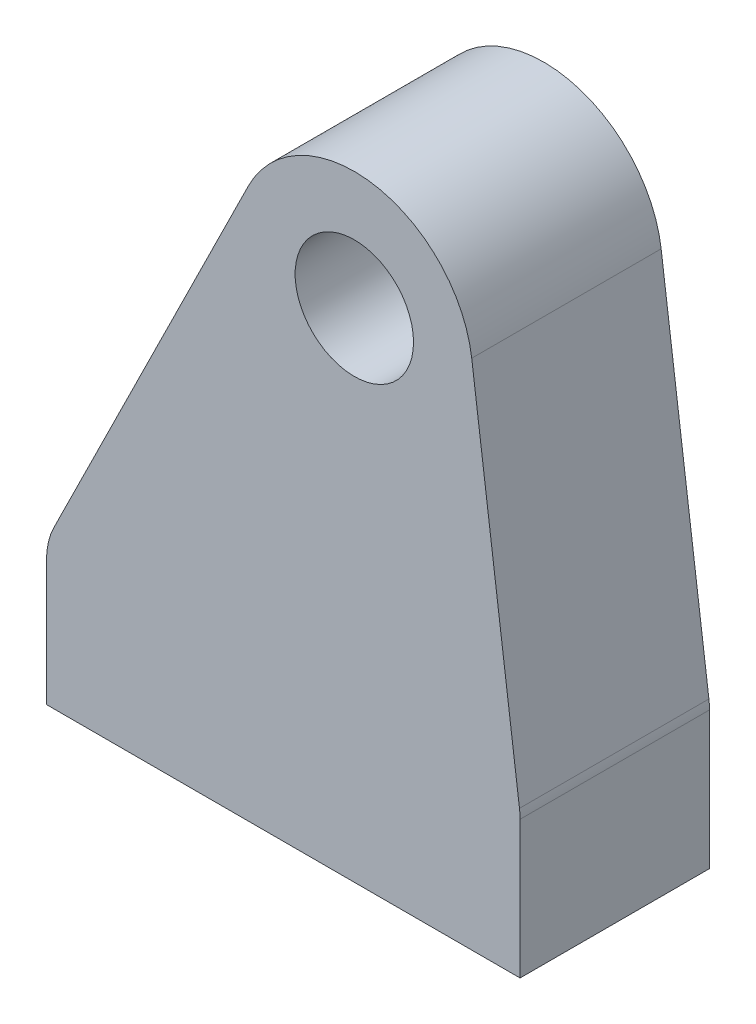
ISO-10303-21;
HEADER;
FILE_DESCRIPTION(('STEP AP214'),'2;1');
FILE_NAME('part.step','',(''),(''),'','','');
FILE_SCHEMA(('AUTOMOTIVE_DESIGN { 1 0 10303 214 1 1 1 1 }'));
ENDSEC;
DATA;
#1=APPLICATION_CONTEXT('core data for automotive mechanical design processes');
#2=APPLICATION_PROTOCOL_DEFINITION('international standard','automotive_design',2000,#1);
#3=PRODUCT_CONTEXT('',#1,'mechanical');
#4=PRODUCT('Part','Part','',(#3));
#5=PRODUCT_RELATED_PRODUCT_CATEGORY('part','',(#4));
#6=PRODUCT_DEFINITION_FORMATION('','',#4);
#7=PRODUCT_DEFINITION_CONTEXT('part definition',#1,'design');
#8=PRODUCT_DEFINITION('design','',#6,#7);
#9=PRODUCT_DEFINITION_SHAPE('','',#8);
#10=(LENGTH_UNIT() NAMED_UNIT(*) SI_UNIT(.MILLI.,.METRE.));
#11=(NAMED_UNIT(*) PLANE_ANGLE_UNIT() SI_UNIT($,.RADIAN.));
#12=(NAMED_UNIT(*) SI_UNIT($,.STERADIAN.) SOLID_ANGLE_UNIT());
#13=UNCERTAINTY_MEASURE_WITH_UNIT(LENGTH_MEASURE(1.E-05),#10,'distance_accuracy_value','');
#14=(GEOMETRIC_REPRESENTATION_CONTEXT(3) GLOBAL_UNCERTAINTY_ASSIGNED_CONTEXT((#13)) GLOBAL_UNIT_ASSIGNED_CONTEXT((#10,
#11,#12)) REPRESENTATION_CONTEXT('',''));
#15=CARTESIAN_POINT('',(0.,0.,0.));
#16=DIRECTION('',(0.,0.,1.));
#17=DIRECTION('',(1.,0.,0.));
#18=AXIS2_PLACEMENT_3D('',#15,#16,#17);
#19=CARTESIAN_POINT('',(3.,21.,8.));
#20=DIRECTION('',(0.,0.,1.));
#21=DIRECTION('',(1.,0.,0.));
#22=AXIS2_PLACEMENT_3D('',#19,#20,#21);
#23=PLANE('',#22);
#24=DIRECTION('',(0.,1.,0.));
#25=VECTOR('',#24,1.);
#26=CARTESIAN_POINT('',(10.,0.,8.));
#27=LINE('',#26,#25);
#28=CARTESIAN_POINT('',(10.,0.,8.));
#29=VERTEX_POINT('',#28);
#30=CARTESIAN_POINT('',(10.,5.80506654048513,8.));
#31=VERTEX_POINT('',#30);
#32=EDGE_CURVE('E117',#29,#31,#27,.T.);
#33=ORIENTED_EDGE('',*,*,#32,.T.);
#34=CARTESIAN_POINT('',(7.,5.80506654048513,8.));
#35=DIRECTION('',(0.,0.,1.));
#36=DIRECTION('',(1.,0.,0.));
#37=AXIS2_PLACEMENT_3D('',#34,#35,#36);
#38=CIRCLE('',#37,3.);
#39=CARTESIAN_POINT('',(9.97477380552072,6.1932943163948,8.));
#40=VERTEX_POINT('',#39);
#41=EDGE_CURVE('E138',#31,#40,#38,.T.);
#42=ORIENTED_EDGE('',*,*,#41,.T.);
#43=DIRECTION('',(-0.129409258636557,0.991591268506907,0.));
#44=VECTOR('',#43,1.);
#45=CARTESIAN_POINT('',(7.95795634253453,21.6470462931828,8.));
#46=LINE('',#45,#44);
#47=CARTESIAN_POINT('',(7.95795634253453,21.6470462931828,8.));
#48=VERTEX_POINT('',#47);
#49=EDGE_CURVE('E335',#40,#48,#46,.T.);
#50=ORIENTED_EDGE('',*,*,#49,.T.);
#51=CARTESIAN_POINT('',(3.,21.,8.));
#52=DIRECTION('',(0.,0.,1.));
#53=DIRECTION('',(1.,0.,0.));
#54=AXIS2_PLACEMENT_3D('',#51,#52,#53);
#55=CIRCLE('',#54,5.);
#56=CARTESIAN_POINT('',(-1.48147957721419,23.2172823002523,8.));
#57=VERTEX_POINT('',#56);
#58=EDGE_CURVE('E174',#48,#57,#55,.T.);
#59=ORIENTED_EDGE('',*,*,#58,.T.);
#60=DIRECTION('',(-0.443456460050459,-0.896295915442838,0.));
#61=VECTOR('',#60,1.);
#62=CARTESIAN_POINT('',(-10.,6.,8.));
#63=LINE('',#62,#61);
#64=CARTESIAN_POINT('',(-9.68888774632852,6.62880726143495,8.));
#65=VERTEX_POINT('',#64);
#66=EDGE_CURVE('E155',#57,#65,#63,.T.);
#67=ORIENTED_EDGE('',*,*,#66,.T.);
#68=CARTESIAN_POINT('',(-7.,5.29843788128358,8.));
#69=DIRECTION('',(0.,0.,1.));
#70=DIRECTION('',(1.,0.,0.));
#71=AXIS2_PLACEMENT_3D('',#68,#69,#70);
#72=CIRCLE('',#71,3.);
#73=CARTESIAN_POINT('',(-10.,5.29843788128357,8.));
#74=VERTEX_POINT('',#73);
#75=EDGE_CURVE('E56',#65,#74,#72,.T.);
#76=ORIENTED_EDGE('',*,*,#75,.T.);
#77=DIRECTION('',(0.,-1.,0.));
#78=VECTOR('',#77,1.);
#79=CARTESIAN_POINT('',(-10.,6.,8.));
#80=LINE('',#79,#78);
#81=CARTESIAN_POINT('',(-10.,0.,8.));
#82=VERTEX_POINT('',#81);
#83=EDGE_CURVE('E98',#74,#82,#80,.T.);
#84=ORIENTED_EDGE('',*,*,#83,.T.);
#85=DIRECTION('',(1.,0.,0.));
#86=VECTOR('',#85,1.);
#87=CARTESIAN_POINT('',(-10.,0.,8.));
#88=LINE('',#87,#86);
#89=EDGE_CURVE('E102',#82,#29,#88,.T.);
#90=ORIENTED_EDGE('',*,*,#89,.T.);
#91=EDGE_LOOP('',(#33,#42,#50,#59,#67,#76,#84,#90));
#92=FACE_BOUND('',#91,.T.);
#93=CARTESIAN_POINT('',(3.,21.,8.));
#94=DIRECTION('',(0.,0.,1.));
#95=DIRECTION('',(1.,0.,0.));
#96=AXIS2_PLACEMENT_3D('',#93,#94,#95);
#97=CIRCLE('',#96,2.5);
#98=CARTESIAN_POINT('',(5.5,21.,8.));
#99=VERTEX_POINT('',#98);
#100=EDGE_CURVE('E147',#99,#99,#97,.T.);
#101=ORIENTED_EDGE('',*,*,#100,.F.);
#102=EDGE_LOOP('',(#101));
#103=FACE_BOUND('',#102,.T.);
#104=ADVANCED_FACE('F36',(#92,#103),#23,.T.);
#105=CARTESIAN_POINT('',(3.,21.,0.));
#106=DIRECTION('',(0.,0.,1.));
#107=DIRECTION('',(1.,0.,0.));
#108=AXIS2_PLACEMENT_3D('',#105,#106,#107);
#109=PLANE('',#108);
#110=DIRECTION('',(-0.129409258636557,0.991591268506907,0.));
#111=VECTOR('',#110,1.);
#112=CARTESIAN_POINT('',(7.95795634253453,21.6470462931828,0.));
#113=LINE('',#112,#111);
#114=CARTESIAN_POINT('',(9.97477380552072,6.1932943163948,0.));
#115=VERTEX_POINT('',#114);
#116=CARTESIAN_POINT('',(7.95795634253453,21.6470462931828,0.));
#117=VERTEX_POINT('',#116);
#118=EDGE_CURVE('E160',#115,#117,#113,.T.);
#119=ORIENTED_EDGE('',*,*,#118,.F.);
#120=CARTESIAN_POINT('',(7.,5.80506654048513,0.));
#121=DIRECTION('',(0.,0.,1.));
#122=DIRECTION('',(1.,0.,0.));
#123=AXIS2_PLACEMENT_3D('',#120,#121,#122);
#124=CIRCLE('',#123,3.);
#125=CARTESIAN_POINT('',(10.,5.80506654048513,0.));
#126=VERTEX_POINT('',#125);
#127=EDGE_CURVE('E133',#115,#126,#124,.F.);
#128=ORIENTED_EDGE('',*,*,#127,.T.);
#129=DIRECTION('',(0.,1.,0.));
#130=VECTOR('',#129,1.);
#131=CARTESIAN_POINT('',(10.,0.,0.));
#132=LINE('',#131,#130);
#133=CARTESIAN_POINT('',(10.,0.,0.));
#134=VERTEX_POINT('',#133);
#135=EDGE_CURVE('E149',#134,#126,#132,.T.);
#136=ORIENTED_EDGE('',*,*,#135,.F.);
#137=DIRECTION('',(1.,0.,0.));
#138=VECTOR('',#137,1.);
#139=CARTESIAN_POINT('',(-10.,0.,0.));
#140=LINE('',#139,#138);
#141=CARTESIAN_POINT('',(-10.,0.,0.));
#142=VERTEX_POINT('',#141);
#143=EDGE_CURVE('E146',#142,#134,#140,.T.);
#144=ORIENTED_EDGE('',*,*,#143,.F.);
#145=DIRECTION('',(0.,-1.,0.));
#146=VECTOR('',#145,1.);
#147=CARTESIAN_POINT('',(-10.,6.,0.));
#148=LINE('',#147,#146);
#149=CARTESIAN_POINT('',(-10.,5.29843788128357,0.));
#150=VERTEX_POINT('',#149);
#151=EDGE_CURVE('E121',#150,#142,#148,.T.);
#152=ORIENTED_EDGE('',*,*,#151,.F.);
#153=CARTESIAN_POINT('',(-7.,5.29843788128358,0.));
#154=DIRECTION('',(0.,0.,1.));
#155=DIRECTION('',(1.,0.,0.));
#156=AXIS2_PLACEMENT_3D('',#153,#154,#155);
#157=CIRCLE('',#156,3.);
#158=CARTESIAN_POINT('',(-9.68888774632852,6.62880726143495,0.));
#159=VERTEX_POINT('',#158);
#160=EDGE_CURVE('E126',#150,#159,#157,.F.);
#161=ORIENTED_EDGE('',*,*,#160,.T.);
#162=DIRECTION('',(-0.443456460050459,-0.896295915442838,0.));
#163=VECTOR('',#162,1.);
#164=CARTESIAN_POINT('',(-10.,6.,0.));
#165=LINE('',#164,#163);
#166=CARTESIAN_POINT('',(-1.48147957721419,23.2172823002523,0.));
#167=VERTEX_POINT('',#166);
#168=EDGE_CURVE('E108',#167,#159,#165,.T.);
#169=ORIENTED_EDGE('',*,*,#168,.F.);
#170=CARTESIAN_POINT('',(3.,21.,0.));
#171=DIRECTION('',(0.,0.,1.));
#172=DIRECTION('',(1.,0.,0.));
#173=AXIS2_PLACEMENT_3D('',#170,#171,#172);
#174=CIRCLE('',#173,5.);
#175=EDGE_CURVE('E162',#117,#167,#174,.T.);
#176=ORIENTED_EDGE('',*,*,#175,.F.);
#177=EDGE_LOOP('',(#119,#128,#136,#144,#152,#161,#169,#176));
#178=FACE_BOUND('',#177,.T.);
#179=CARTESIAN_POINT('',(3.,21.,0.));
#180=DIRECTION('',(0.,0.,1.));
#181=DIRECTION('',(1.,0.,0.));
#182=AXIS2_PLACEMENT_3D('',#179,#180,#181);
#183=CIRCLE('',#182,2.5);
#184=CARTESIAN_POINT('',(5.5,21.,0.));
#185=VERTEX_POINT('',#184);
#186=EDGE_CURVE('E152',#185,#185,#183,.T.);
#187=ORIENTED_EDGE('',*,*,#186,.T.);
#188=EDGE_LOOP('',(#187));
#189=FACE_BOUND('',#188,.T.);
#190=ADVANCED_FACE('F142',(#178,#189),#109,.F.);
#191=CARTESIAN_POINT('',(-10.,6.,8.));
#192=DIRECTION('',(1.,0.,0.));
#193=DIRECTION('',(0.,1.,0.));
#194=AXIS2_PLACEMENT_3D('',#191,#192,#193);
#195=PLANE('',#194);
#196=ORIENTED_EDGE('',*,*,#83,.F.);
#197=DIRECTION('',(0.,0.,-1.));
#198=VECTOR('',#197,1.);
#199=CARTESIAN_POINT('',(-10.,5.29843788128357,8.));
#200=LINE('',#199,#198);
#201=EDGE_CURVE('E44',#74,#150,#200,.T.);
#202=ORIENTED_EDGE('',*,*,#201,.T.);
#203=ORIENTED_EDGE('',*,*,#151,.T.);
#204=DIRECTION('',(0.,0.,-1.));
#205=VECTOR('',#204,1.);
#206=CARTESIAN_POINT('',(-10.,0.,8.));
#207=LINE('',#206,#205);
#208=EDGE_CURVE('E113',#82,#142,#207,.T.);
#209=ORIENTED_EDGE('',*,*,#208,.F.);
#210=EDGE_LOOP('',(#196,#202,#203,#209));
#211=FACE_BOUND('',#210,.T.);
#212=ADVANCED_FACE('F119',(#211),#195,.F.);
#213=CARTESIAN_POINT('',(-10.,0.,8.));
#214=DIRECTION('',(0.,1.,0.));
#215=DIRECTION('',(0.,0.,1.));
#216=AXIS2_PLACEMENT_3D('',#213,#214,#215);
#217=PLANE('',#216);
#218=CARTESIAN_POINT('',(-6.,0.,4.));
#219=DIRECTION('',(0.,-1.,0.));
#220=DIRECTION('',(0.,0.,-1.));
#221=AXIS2_PLACEMENT_3D('',#218,#219,#220);
#222=CIRCLE('',#221,1.5);
#223=CARTESIAN_POINT('',(-6.,0.,2.5));
#224=VERTEX_POINT('',#223);
#225=EDGE_CURVE('E321',#224,#224,#222,.T.);
#226=ORIENTED_EDGE('',*,*,#225,.F.);
#227=EDGE_LOOP('',(#226));
#228=FACE_BOUND('',#227,.T.);
#229=CARTESIAN_POINT('',(6.,0.,4.));
#230=DIRECTION('',(0.,-1.,0.));
#231=DIRECTION('',(0.,0.,-1.));
#232=AXIS2_PLACEMENT_3D('',#229,#230,#231);
#233=CIRCLE('',#232,1.5);
#234=CARTESIAN_POINT('',(6.,0.,2.5));
#235=VERTEX_POINT('',#234);
#236=EDGE_CURVE('E331',#235,#235,#233,.T.);
#237=ORIENTED_EDGE('',*,*,#236,.F.);
#238=EDGE_LOOP('',(#237));
#239=FACE_BOUND('',#238,.T.);
#240=ORIENTED_EDGE('',*,*,#143,.T.);
#241=DIRECTION('',(0.,0.,-1.));
#242=VECTOR('',#241,1.);
#243=CARTESIAN_POINT('',(10.,0.,8.));
#244=LINE('',#243,#242);
#245=EDGE_CURVE('E115',#29,#134,#244,.T.);
#246=ORIENTED_EDGE('',*,*,#245,.F.);
#247=ORIENTED_EDGE('',*,*,#89,.F.);
#248=ORIENTED_EDGE('',*,*,#208,.T.);
#249=EDGE_LOOP('',(#240,#246,#247,#248));
#250=FACE_BOUND('',#249,.T.);
#251=ADVANCED_FACE('F112',(#228,#239,#250),#217,.F.);
#252=CARTESIAN_POINT('',(10.,0.,8.));
#253=DIRECTION('',(-1.,0.,0.));
#254=DIRECTION('',(0.,-1.,0.));
#255=AXIS2_PLACEMENT_3D('',#252,#253,#254);
#256=PLANE('',#255);
#257=ORIENTED_EDGE('',*,*,#135,.T.);
#258=DIRECTION('',(0.,0.,-1.));
#259=VECTOR('',#258,1.);
#260=CARTESIAN_POINT('',(10.,5.80506654048513,8.));
#261=LINE('',#260,#259);
#262=EDGE_CURVE('E135',#126,#31,#261,.F.);
#263=ORIENTED_EDGE('',*,*,#262,.T.);
#264=ORIENTED_EDGE('',*,*,#32,.F.);
#265=ORIENTED_EDGE('',*,*,#245,.T.);
#266=EDGE_LOOP('',(#257,#263,#264,#265));
#267=FACE_BOUND('',#266,.T.);
#268=ADVANCED_FACE('F202',(#267),#256,.F.);
#269=CARTESIAN_POINT('',(7.95795634253453,21.6470462931828,8.));
#270=DIRECTION('',(-0.991591268506907,-0.129409258636557,0.));
#271=DIRECTION('',(0.129409258636557,-0.991591268506907,0.));
#272=AXIS2_PLACEMENT_3D('',#269,#270,#271);
#273=PLANE('',#272);
#274=ORIENTED_EDGE('',*,*,#49,.F.);
#275=DIRECTION('',(0.,0.,-1.));
#276=VECTOR('',#275,1.);
#277=CARTESIAN_POINT('',(9.97477380552072,6.1932943163948,8.));
#278=LINE('',#277,#276);
#279=EDGE_CURVE('E123',#40,#115,#278,.T.);
#280=ORIENTED_EDGE('',*,*,#279,.T.);
#281=ORIENTED_EDGE('',*,*,#118,.T.);
#282=DIRECTION('',(0.,0.,-1.));
#283=VECTOR('',#282,1.);
#284=CARTESIAN_POINT('',(7.95795634253453,21.6470462931828,8.));
#285=LINE('',#284,#283);
#286=EDGE_CURVE('E128',#48,#117,#285,.T.);
#287=ORIENTED_EDGE('',*,*,#286,.F.);
#288=EDGE_LOOP('',(#274,#280,#281,#287));
#289=FACE_BOUND('',#288,.T.);
#290=ADVANCED_FACE('F199',(#289),#273,.F.);
#291=CARTESIAN_POINT('',(3.,21.,8.));
#292=DIRECTION('',(0.,0.,-1.));
#293=DIRECTION('',(-1.,0.,0.));
#294=AXIS2_PLACEMENT_3D('',#291,#292,#293);
#295=CYLINDRICAL_SURFACE('',#294,5.);
#296=ORIENTED_EDGE('',*,*,#175,.T.);
#297=DIRECTION('',(0.,0.,-1.));
#298=VECTOR('',#297,1.);
#299=CARTESIAN_POINT('',(-1.48147957721419,23.2172823002523,8.));
#300=LINE('',#299,#298);
#301=EDGE_CURVE('E165',#57,#167,#300,.T.);
#302=ORIENTED_EDGE('',*,*,#301,.F.);
#303=ORIENTED_EDGE('',*,*,#58,.F.);
#304=ORIENTED_EDGE('',*,*,#286,.T.);
#305=EDGE_LOOP('',(#296,#302,#303,#304));
#306=FACE_BOUND('',#305,.T.);
#307=ADVANCED_FACE('F172',(#306),#295,.T.);
#308=CARTESIAN_POINT('',(-10.,6.,8.));
#309=DIRECTION('',(0.896295915442838,-0.443456460050459,0.));
#310=DIRECTION('',(0.443456460050459,0.896295915442838,0.));
#311=AXIS2_PLACEMENT_3D('',#308,#309,#310);
#312=PLANE('',#311);
#313=ORIENTED_EDGE('',*,*,#168,.T.);
#314=DIRECTION('',(0.,0.,-1.));
#315=VECTOR('',#314,1.);
#316=CARTESIAN_POINT('',(-9.68888774632852,6.62880726143495,8.));
#317=LINE('',#316,#315);
#318=EDGE_CURVE('E11',#159,#65,#317,.F.);
#319=ORIENTED_EDGE('',*,*,#318,.T.);
#320=ORIENTED_EDGE('',*,*,#66,.F.);
#321=ORIENTED_EDGE('',*,*,#301,.T.);
#322=EDGE_LOOP('',(#313,#319,#320,#321));
#323=FACE_BOUND('',#322,.T.);
#324=ADVANCED_FACE('F177',(#323),#312,.F.);
#325=CARTESIAN_POINT('',(3.,21.,8.));
#326=DIRECTION('',(0.,0.,-1.));
#327=DIRECTION('',(-1.,0.,0.));
#328=AXIS2_PLACEMENT_3D('',#325,#326,#327);
#329=CYLINDRICAL_SURFACE('',#328,2.5);
#330=ORIENTED_EDGE('',*,*,#100,.T.);
#331=EDGE_LOOP('',(#330));
#332=FACE_BOUND('',#331,.T.);
#333=ORIENTED_EDGE('',*,*,#186,.F.);
#334=EDGE_LOOP('',(#333));
#335=FACE_BOUND('',#334,.T.);
#336=ADVANCED_FACE('F192',(#332,#335),#329,.F.);
#337=CARTESIAN_POINT('',(6.,10.,4.));
#338=DIRECTION('',(0.,-1.,0.));
#339=DIRECTION('',(0.,0.,-1.));
#340=AXIS2_PLACEMENT_3D('',#337,#338,#339);
#341=CYLINDRICAL_SURFACE('',#340,1.5);
#342=CARTESIAN_POINT('',(6.,10.,4.));
#343=DIRECTION('',(0.,-1.,0.));
#344=DIRECTION('',(0.,0.,-1.));
#345=AXIS2_PLACEMENT_3D('',#342,#343,#344);
#346=CIRCLE('',#345,1.5);
#347=CARTESIAN_POINT('',(6.,10.,2.5));
#348=VERTEX_POINT('',#347);
#349=EDGE_CURVE('E326',#348,#348,#346,.T.);
#350=ORIENTED_EDGE('',*,*,#349,.F.);
#351=EDGE_LOOP('',(#350));
#352=FACE_BOUND('',#351,.T.);
#353=ORIENTED_EDGE('',*,*,#236,.T.);
#354=EDGE_LOOP('',(#353));
#355=FACE_BOUND('',#354,.T.);
#356=ADVANCED_FACE('F243',(#352,#355),#341,.F.);
#357=CARTESIAN_POINT('',(6.,10.,4.));
#358=DIRECTION('',(0.,-1.,0.));
#359=DIRECTION('',(0.,0.,-1.));
#360=AXIS2_PLACEMENT_3D('',#357,#358,#359);
#361=PLANE('',#360);
#362=ORIENTED_EDGE('',*,*,#349,.T.);
#363=EDGE_LOOP('',(#362));
#364=FACE_BOUND('',#363,.T.);
#365=ADVANCED_FACE('F250',(#364),#361,.T.);
#366=CARTESIAN_POINT('',(-6.,10.,4.));
#367=DIRECTION('',(0.,-1.,0.));
#368=DIRECTION('',(0.,0.,-1.));
#369=AXIS2_PLACEMENT_3D('',#366,#367,#368);
#370=CYLINDRICAL_SURFACE('',#369,1.5);
#371=CARTESIAN_POINT('',(-6.,10.,4.));
#372=DIRECTION('',(0.,-1.,0.));
#373=DIRECTION('',(0.,0.,-1.));
#374=AXIS2_PLACEMENT_3D('',#371,#372,#373);
#375=CIRCLE('',#374,1.5);
#376=CARTESIAN_POINT('',(-6.,10.,2.5));
#377=VERTEX_POINT('',#376);
#378=EDGE_CURVE('E320',#377,#377,#375,.T.);
#379=ORIENTED_EDGE('',*,*,#378,.F.);
#380=EDGE_LOOP('',(#379));
#381=FACE_BOUND('',#380,.T.);
#382=ORIENTED_EDGE('',*,*,#225,.T.);
#383=EDGE_LOOP('',(#382));
#384=FACE_BOUND('',#383,.T.);
#385=ADVANCED_FACE('F256',(#381,#384),#370,.F.);
#386=CARTESIAN_POINT('',(-6.,10.,4.));
#387=DIRECTION('',(0.,-1.,0.));
#388=DIRECTION('',(0.,0.,-1.));
#389=AXIS2_PLACEMENT_3D('',#386,#387,#388);
#390=PLANE('',#389);
#391=ORIENTED_EDGE('',*,*,#378,.T.);
#392=EDGE_LOOP('',(#391));
#393=FACE_BOUND('',#392,.T.);
#394=ADVANCED_FACE('F183',(#393),#390,.T.);
#395=CARTESIAN_POINT('',(7.,5.80506654048513,8.));
#396=DIRECTION('',(0.,0.,-1.));
#397=DIRECTION('',(-1.,0.,0.));
#398=AXIS2_PLACEMENT_3D('',#395,#396,#397);
#399=CYLINDRICAL_SURFACE('',#398,3.);
#400=ORIENTED_EDGE('',*,*,#41,.F.);
#401=ORIENTED_EDGE('',*,*,#262,.F.);
#402=ORIENTED_EDGE('',*,*,#127,.F.);
#403=ORIENTED_EDGE('',*,*,#279,.F.);
#404=EDGE_LOOP('',(#400,#401,#402,#403));
#405=FACE_BOUND('',#404,.T.);
#406=ADVANCED_FACE('F179',(#405),#399,.T.);
#407=CARTESIAN_POINT('',(-7.,5.29843788128358,8.));
#408=DIRECTION('',(0.,0.,-1.));
#409=DIRECTION('',(-1.,0.,0.));
#410=AXIS2_PLACEMENT_3D('',#407,#408,#409);
#411=CYLINDRICAL_SURFACE('',#410,3.);
#412=ORIENTED_EDGE('',*,*,#75,.F.);
#413=ORIENTED_EDGE('',*,*,#318,.F.);
#414=ORIENTED_EDGE('',*,*,#160,.F.);
#415=ORIENTED_EDGE('',*,*,#201,.F.);
#416=EDGE_LOOP('',(#412,#413,#414,#415));
#417=FACE_BOUND('',#416,.T.);
#418=ADVANCED_FACE('F38',(#417),#411,.T.);
#419=CLOSED_SHELL('',(#104,#190,#212,#251,#268,#290,#307,#324,#336,#356,#365,#385,#394,#406,#418));
#420=MANIFOLD_SOLID_BREP('B2',#419);
#421=ADVANCED_BREP_SHAPE_REPRESENTATION('',(#18,#420),#14);
#422=SHAPE_DEFINITION_REPRESENTATION(#9,#421);
ENDSEC;
END-ISO-10303-21;
